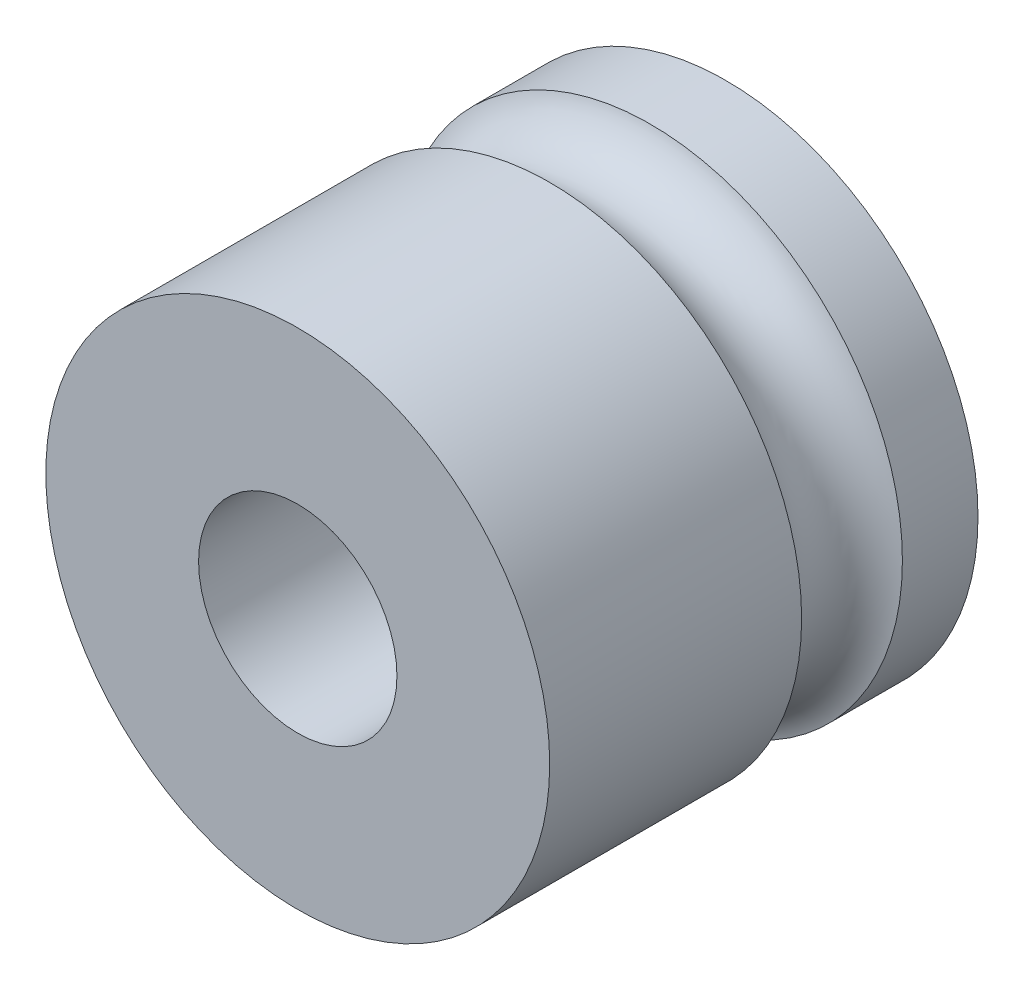
ISO-10303-21;
HEADER;
FILE_DESCRIPTION(('STEP AP214'),'2;1');
FILE_NAME('part.step','',(''),(''),'','','');
FILE_SCHEMA(('AUTOMOTIVE_DESIGN { 1 0 10303 214 1 1 1 1 }'));
ENDSEC;
DATA;
#1=APPLICATION_CONTEXT('core data for automotive mechanical design processes');
#2=APPLICATION_PROTOCOL_DEFINITION('international standard','automotive_design',2000,#1);
#3=PRODUCT_CONTEXT('',#1,'mechanical');
#4=PRODUCT('Part','Part','',(#3));
#5=PRODUCT_RELATED_PRODUCT_CATEGORY('part','',(#4));
#6=PRODUCT_DEFINITION_FORMATION('','',#4);
#7=PRODUCT_DEFINITION_CONTEXT('part definition',#1,'design');
#8=PRODUCT_DEFINITION('design','',#6,#7);
#9=PRODUCT_DEFINITION_SHAPE('','',#8);
#10=(LENGTH_UNIT() NAMED_UNIT(*) SI_UNIT(.MILLI.,.METRE.));
#11=(NAMED_UNIT(*) PLANE_ANGLE_UNIT() SI_UNIT($,.RADIAN.));
#12=(NAMED_UNIT(*) SI_UNIT($,.STERADIAN.) SOLID_ANGLE_UNIT());
#13=UNCERTAINTY_MEASURE_WITH_UNIT(LENGTH_MEASURE(1.E-05),#10,'distance_accuracy_value','');
#14=(GEOMETRIC_REPRESENTATION_CONTEXT(3) GLOBAL_UNCERTAINTY_ASSIGNED_CONTEXT((#13)) GLOBAL_UNIT_ASSIGNED_CONTEXT((#10,
#11,#12)) REPRESENTATION_CONTEXT('',''));
#15=CARTESIAN_POINT('',(0.,0.,0.));
#16=DIRECTION('',(0.,0.,1.));
#17=DIRECTION('',(1.,0.,0.));
#18=AXIS2_PLACEMENT_3D('',#15,#16,#17);
#19=CARTESIAN_POINT('',(4.425,0.,0.));
#20=DIRECTION('',(0.,0.,-1.));
#21=DIRECTION('',(-1.,0.,0.));
#22=AXIS2_PLACEMENT_3D('',#19,#20,#21);
#23=PLANE('',#22);
#24=CARTESIAN_POINT('',(0.,0.,0.));
#25=DIRECTION('',(0.,0.,1.));
#26=DIRECTION('',(1.,0.,0.));
#27=AXIS2_PLACEMENT_3D('',#24,#25,#26);
#28=CIRCLE('',#27,6.35);
#29=CARTESIAN_POINT('',(6.35,0.,0.));
#30=VERTEX_POINT('',#29);
#31=EDGE_CURVE('E21',#30,#30,#28,.T.);
#32=ORIENTED_EDGE('',*,*,#31,.F.);
#33=EDGE_LOOP('',(#32));
#34=FACE_BOUND('',#33,.T.);
#35=CARTESIAN_POINT('',(0.,0.,0.));
#36=DIRECTION('',(0.,0.,1.));
#37=DIRECTION('',(1.,0.,0.));
#38=AXIS2_PLACEMENT_3D('',#35,#36,#37);
#39=CIRCLE('',#38,2.5);
#40=CARTESIAN_POINT('',(2.5,0.,0.));
#41=VERTEX_POINT('',#40);
#42=EDGE_CURVE('E8',#41,#41,#39,.T.);
#43=ORIENTED_EDGE('',*,*,#42,.T.);
#44=EDGE_LOOP('',(#43));
#45=FACE_BOUND('',#44,.T.);
#46=ADVANCED_FACE('F13',(#34,#45),#23,.T.);
#47=CARTESIAN_POINT('',(0.,0.,0.952499999999998));
#48=DIRECTION('',(0.,0.,1.));
#49=DIRECTION('',(1.,0.,0.));
#50=AXIS2_PLACEMENT_3D('',#47,#48,#49);
#51=CYLINDRICAL_SURFACE('',#50,6.35);
#52=CARTESIAN_POINT('',(0.,0.,1.905));
#53=DIRECTION('',(0.,0.,1.));
#54=DIRECTION('',(1.,0.,0.));
#55=AXIS2_PLACEMENT_3D('',#52,#53,#54);
#56=CIRCLE('',#55,6.35);
#57=CARTESIAN_POINT('',(6.35,0.,1.905));
#58=VERTEX_POINT('',#57);
#59=EDGE_CURVE('E26',#58,#58,#56,.T.);
#60=ORIENTED_EDGE('',*,*,#59,.F.);
#61=EDGE_LOOP('',(#60));
#62=FACE_BOUND('',#61,.T.);
#63=ORIENTED_EDGE('',*,*,#31,.T.);
#64=EDGE_LOOP('',(#63));
#65=FACE_BOUND('',#64,.T.);
#66=ADVANCED_FACE('F56',(#62,#65),#51,.T.);
#67=CARTESIAN_POINT('',(0.,0.,3.175));
#68=DIRECTION('',(0.,0.,1.));
#69=DIRECTION('',(1.,0.,0.));
#70=AXIS2_PLACEMENT_3D('',#67,#68,#69);
#71=TOROIDAL_SURFACE('',#70,6.72041666666667,1.32291666666667);
#72=ORIENTED_EDGE('',*,*,#59,.T.);
#73=EDGE_LOOP('',(#72));
#74=FACE_BOUND('',#73,.T.);
#75=CARTESIAN_POINT('',(0.,0.,4.445));
#76=DIRECTION('',(0.,0.,1.));
#77=DIRECTION('',(1.,0.,0.));
#78=AXIS2_PLACEMENT_3D('',#75,#76,#77);
#79=CIRCLE('',#78,6.35);
#80=CARTESIAN_POINT('',(6.35,0.,4.445));
#81=VERTEX_POINT('',#80);
#82=EDGE_CURVE('E31',#81,#81,#79,.T.);
#83=ORIENTED_EDGE('',*,*,#82,.F.);
#84=EDGE_LOOP('',(#83));
#85=FACE_BOUND('',#84,.T.);
#86=ADVANCED_FACE('F51',(#74,#85),#71,.F.);
#87=CARTESIAN_POINT('',(0.,0.,7.62));
#88=DIRECTION('',(0.,0.,1.));
#89=DIRECTION('',(1.,0.,0.));
#90=AXIS2_PLACEMENT_3D('',#87,#88,#89);
#91=CYLINDRICAL_SURFACE('',#90,6.35);
#92=CARTESIAN_POINT('',(0.,0.,10.795));
#93=DIRECTION('',(0.,0.,1.));
#94=DIRECTION('',(1.,0.,0.));
#95=AXIS2_PLACEMENT_3D('',#92,#93,#94);
#96=CIRCLE('',#95,6.35);
#97=CARTESIAN_POINT('',(6.35,0.,10.795));
#98=VERTEX_POINT('',#97);
#99=EDGE_CURVE('E33',#98,#98,#96,.T.);
#100=ORIENTED_EDGE('',*,*,#99,.F.);
#101=EDGE_LOOP('',(#100));
#102=FACE_BOUND('',#101,.T.);
#103=ORIENTED_EDGE('',*,*,#82,.T.);
#104=EDGE_LOOP('',(#103));
#105=FACE_BOUND('',#104,.T.);
#106=ADVANCED_FACE('F43',(#102,#105),#91,.T.);
#107=CARTESIAN_POINT('',(4.425,0.,10.795));
#108=DIRECTION('',(0.,0.,1.));
#109=DIRECTION('',(1.,0.,0.));
#110=AXIS2_PLACEMENT_3D('',#107,#108,#109);
#111=PLANE('',#110);
#112=CARTESIAN_POINT('',(0.,0.,10.795));
#113=DIRECTION('',(0.,0.,1.));
#114=DIRECTION('',(1.,0.,0.));
#115=AXIS2_PLACEMENT_3D('',#112,#113,#114);
#116=CIRCLE('',#115,2.5);
#117=CARTESIAN_POINT('',(2.5,0.,10.795));
#118=VERTEX_POINT('',#117);
#119=EDGE_CURVE('E17',#118,#118,#116,.T.);
#120=ORIENTED_EDGE('',*,*,#119,.F.);
#121=EDGE_LOOP('',(#120));
#122=FACE_BOUND('',#121,.T.);
#123=ORIENTED_EDGE('',*,*,#99,.T.);
#124=EDGE_LOOP('',(#123));
#125=FACE_BOUND('',#124,.T.);
#126=ADVANCED_FACE('F41',(#122,#125),#111,.T.);
#127=CARTESIAN_POINT('',(0.,0.,5.3975));
#128=DIRECTION('',(0.,0.,1.));
#129=DIRECTION('',(1.,0.,0.));
#130=AXIS2_PLACEMENT_3D('',#127,#128,#129);
#131=CYLINDRICAL_SURFACE('',#130,2.5);
#132=ORIENTED_EDGE('',*,*,#42,.F.);
#133=EDGE_LOOP('',(#132));
#134=FACE_BOUND('',#133,.T.);
#135=ORIENTED_EDGE('',*,*,#119,.T.);
#136=EDGE_LOOP('',(#135));
#137=FACE_BOUND('',#136,.T.);
#138=ADVANCED_FACE('F15',(#134,#137),#131,.F.);
#139=CLOSED_SHELL('',(#46,#66,#86,#106,#126,#138));
#140=MANIFOLD_SOLID_BREP('B1',#139);
#141=ADVANCED_BREP_SHAPE_REPRESENTATION('',(#18,#140),#14);
#142=SHAPE_DEFINITION_REPRESENTATION(#9,#141);
ENDSEC;
END-ISO-10303-21;
